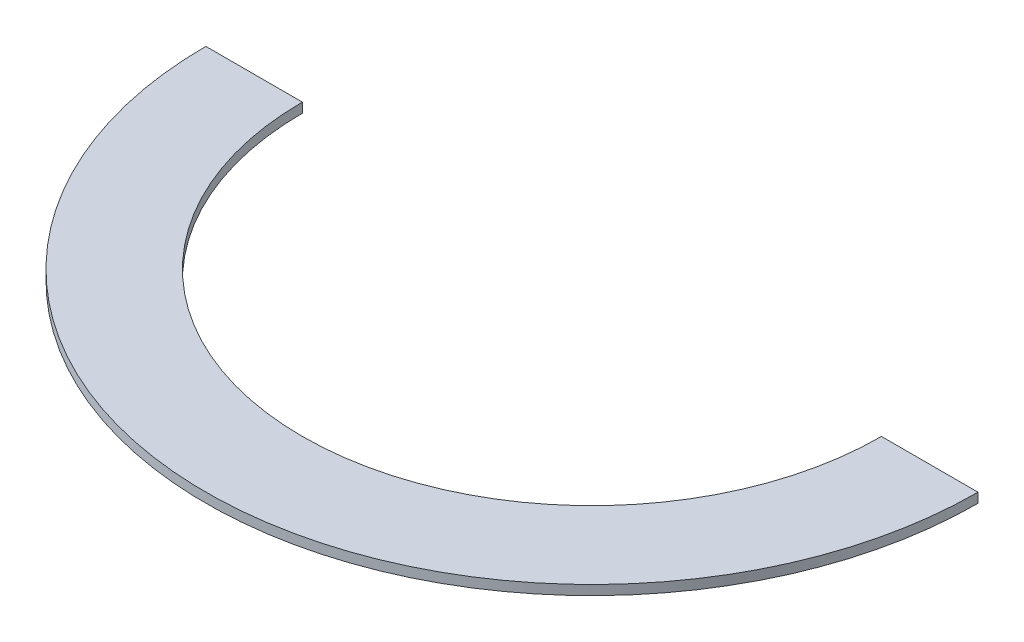
ISO-10303-21;
HEADER;
FILE_DESCRIPTION(('STEP AP214'),'2;1');
FILE_NAME('part.step','',(''),(''),'','','');
FILE_SCHEMA(('AUTOMOTIVE_DESIGN { 1 0 10303 214 1 1 1 1 }'));
ENDSEC;
DATA;
#1=APPLICATION_CONTEXT('core data for automotive mechanical design processes');
#2=APPLICATION_PROTOCOL_DEFINITION('international standard','automotive_design',2000,#1);
#3=PRODUCT_CONTEXT('',#1,'mechanical');
#4=PRODUCT('Part','Part','',(#3));
#5=PRODUCT_RELATED_PRODUCT_CATEGORY('part','',(#4));
#6=PRODUCT_DEFINITION_FORMATION('','',#4);
#7=PRODUCT_DEFINITION_CONTEXT('part definition',#1,'design');
#8=PRODUCT_DEFINITION('design','',#6,#7);
#9=PRODUCT_DEFINITION_SHAPE('','',#8);
#10=(LENGTH_UNIT() NAMED_UNIT(*) SI_UNIT(.MILLI.,.METRE.));
#11=(NAMED_UNIT(*) PLANE_ANGLE_UNIT() SI_UNIT($,.RADIAN.));
#12=(NAMED_UNIT(*) SI_UNIT($,.STERADIAN.) SOLID_ANGLE_UNIT());
#13=UNCERTAINTY_MEASURE_WITH_UNIT(LENGTH_MEASURE(1.E-05),#10,'distance_accuracy_value','');
#14=(GEOMETRIC_REPRESENTATION_CONTEXT(3) GLOBAL_UNCERTAINTY_ASSIGNED_CONTEXT((#13)) GLOBAL_UNIT_ASSIGNED_CONTEXT((#10,
#11,#12)) REPRESENTATION_CONTEXT('',''));
#15=CARTESIAN_POINT('',(0.,0.,0.));
#16=DIRECTION('',(0.,0.,1.));
#17=DIRECTION('',(1.,0.,0.));
#18=AXIS2_PLACEMENT_3D('',#15,#16,#17);
#19=CARTESIAN_POINT('',(400.,10.,0.));
#20=DIRECTION('',(0.,-1.,0.));
#21=DIRECTION('',(0.,0.,-1.));
#22=AXIS2_PLACEMENT_3D('',#19,#20,#21);
#23=CYLINDRICAL_SURFACE('',#22,400.);
#24=CARTESIAN_POINT('',(400.,0.,0.));
#25=DIRECTION('',(0.,1.,0.));
#26=DIRECTION('',(0.,0.,1.));
#27=AXIS2_PLACEMENT_3D('',#24,#25,#26);
#28=CIRCLE('',#27,400.);
#29=CARTESIAN_POINT('',(0.,0.,0.));
#30=VERTEX_POINT('',#29);
#31=CARTESIAN_POINT('',(800.,0.,0.));
#32=VERTEX_POINT('',#31);
#33=EDGE_CURVE('E94',#30,#32,#28,.T.);
#34=ORIENTED_EDGE('',*,*,#33,.T.);
#35=DIRECTION('',(0.,-1.,0.));
#36=VECTOR('',#35,1.);
#37=CARTESIAN_POINT('',(800.,10.,0.));
#38=LINE('',#37,#36);
#39=CARTESIAN_POINT('',(800.,10.,0.));
#40=VERTEX_POINT('',#39);
#41=EDGE_CURVE('E11',#40,#32,#38,.T.);
#42=ORIENTED_EDGE('',*,*,#41,.F.);
#43=CARTESIAN_POINT('',(400.,10.,0.));
#44=DIRECTION('',(0.,1.,0.));
#45=DIRECTION('',(0.,0.,1.));
#46=AXIS2_PLACEMENT_3D('',#43,#44,#45);
#47=CIRCLE('',#46,400.);
#48=CARTESIAN_POINT('',(0.,10.,0.));
#49=VERTEX_POINT('',#48);
#50=EDGE_CURVE('E82',#49,#40,#47,.T.);
#51=ORIENTED_EDGE('',*,*,#50,.F.);
#52=DIRECTION('',(0.,-1.,0.));
#53=VECTOR('',#52,1.);
#54=CARTESIAN_POINT('',(0.,10.,0.));
#55=LINE('',#54,#53);
#56=EDGE_CURVE('E90',#49,#30,#55,.T.);
#57=ORIENTED_EDGE('',*,*,#56,.T.);
#58=EDGE_LOOP('',(#34,#42,#51,#57));
#59=FACE_BOUND('',#58,.T.);
#60=ADVANCED_FACE('F31',(#59),#23,.T.);
#61=CARTESIAN_POINT('',(700.,10.,0.));
#62=DIRECTION('',(0.,0.,1.));
#63=DIRECTION('',(1.,0.,0.));
#64=AXIS2_PLACEMENT_3D('',#61,#62,#63);
#65=PLANE('',#64);
#66=DIRECTION('',(-1.,0.,0.));
#67=VECTOR('',#66,1.);
#68=CARTESIAN_POINT('',(700.,0.,0.));
#69=LINE('',#68,#67);
#70=CARTESIAN_POINT('',(700.,0.,0.));
#71=VERTEX_POINT('',#70);
#72=EDGE_CURVE('E86',#32,#71,#69,.T.);
#73=ORIENTED_EDGE('',*,*,#72,.T.);
#74=DIRECTION('',(0.,-1.,0.));
#75=VECTOR('',#74,1.);
#76=CARTESIAN_POINT('',(700.,10.,0.));
#77=LINE('',#76,#75);
#78=CARTESIAN_POINT('',(700.,10.,0.));
#79=VERTEX_POINT('',#78);
#80=EDGE_CURVE('E39',#79,#71,#77,.T.);
#81=ORIENTED_EDGE('',*,*,#80,.F.);
#82=DIRECTION('',(-1.,0.,0.));
#83=VECTOR('',#82,1.);
#84=CARTESIAN_POINT('',(700.,10.,0.));
#85=LINE('',#84,#83);
#86=EDGE_CURVE('E77',#40,#79,#85,.T.);
#87=ORIENTED_EDGE('',*,*,#86,.F.);
#88=ORIENTED_EDGE('',*,*,#41,.T.);
#89=EDGE_LOOP('',(#73,#81,#87,#88));
#90=FACE_BOUND('',#89,.T.);
#91=ADVANCED_FACE('F85',(#90),#65,.F.);
#92=CARTESIAN_POINT('',(400.,10.,0.));
#93=DIRECTION('',(0.,-1.,0.));
#94=DIRECTION('',(0.,0.,-1.));
#95=AXIS2_PLACEMENT_3D('',#92,#93,#94);
#96=CYLINDRICAL_SURFACE('',#95,300.);
#97=CARTESIAN_POINT('',(400.,0.,0.));
#98=DIRECTION('',(0.,-1.,0.));
#99=DIRECTION('',(0.,0.,1.));
#100=AXIS2_PLACEMENT_3D('',#97,#98,#99);
#101=CIRCLE('',#100,300.);
#102=CARTESIAN_POINT('',(100.,0.,0.));
#103=VERTEX_POINT('',#102);
#104=EDGE_CURVE('E64',#71,#103,#101,.T.);
#105=ORIENTED_EDGE('',*,*,#104,.T.);
#106=DIRECTION('',(0.,-1.,0.));
#107=VECTOR('',#106,1.);
#108=CARTESIAN_POINT('',(100.,10.,0.));
#109=LINE('',#108,#107);
#110=CARTESIAN_POINT('',(100.,10.,0.));
#111=VERTEX_POINT('',#110);
#112=EDGE_CURVE('E87',#111,#103,#109,.T.);
#113=ORIENTED_EDGE('',*,*,#112,.F.);
#114=CARTESIAN_POINT('',(400.,10.,0.));
#115=DIRECTION('',(0.,-1.,0.));
#116=DIRECTION('',(0.,0.,1.));
#117=AXIS2_PLACEMENT_3D('',#114,#115,#116);
#118=CIRCLE('',#117,300.);
#119=EDGE_CURVE('E80',#79,#111,#118,.T.);
#120=ORIENTED_EDGE('',*,*,#119,.F.);
#121=ORIENTED_EDGE('',*,*,#80,.T.);
#122=EDGE_LOOP('',(#105,#113,#120,#121));
#123=FACE_BOUND('',#122,.T.);
#124=ADVANCED_FACE('F88',(#123),#96,.F.);
#125=CARTESIAN_POINT('',(0.,10.,0.));
#126=DIRECTION('',(0.,0.,1.));
#127=DIRECTION('',(1.,0.,0.));
#128=AXIS2_PLACEMENT_3D('',#125,#126,#127);
#129=PLANE('',#128);
#130=DIRECTION('',(-1.,0.,0.));
#131=VECTOR('',#130,1.);
#132=CARTESIAN_POINT('',(0.,0.,0.));
#133=LINE('',#132,#131);
#134=EDGE_CURVE('E70',#103,#30,#133,.T.);
#135=ORIENTED_EDGE('',*,*,#134,.T.);
#136=ORIENTED_EDGE('',*,*,#56,.F.);
#137=DIRECTION('',(-1.,0.,0.));
#138=VECTOR('',#137,1.);
#139=CARTESIAN_POINT('',(0.,10.,0.));
#140=LINE('',#139,#138);
#141=EDGE_CURVE('E47',#111,#49,#140,.T.);
#142=ORIENTED_EDGE('',*,*,#141,.F.);
#143=ORIENTED_EDGE('',*,*,#112,.T.);
#144=EDGE_LOOP('',(#135,#136,#142,#143));
#145=FACE_BOUND('',#144,.T.);
#146=ADVANCED_FACE('F101',(#145),#129,.F.);
#147=CARTESIAN_POINT('',(400.,10.,0.));
#148=DIRECTION('',(0.,1.,0.));
#149=DIRECTION('',(0.,0.,1.));
#150=AXIS2_PLACEMENT_3D('',#147,#148,#149);
#151=PLANE('',#150);
#152=ORIENTED_EDGE('',*,*,#50,.T.);
#153=ORIENTED_EDGE('',*,*,#86,.T.);
#154=ORIENTED_EDGE('',*,*,#119,.T.);
#155=ORIENTED_EDGE('',*,*,#141,.T.);
#156=EDGE_LOOP('',(#152,#153,#154,#155));
#157=FACE_BOUND('',#156,.T.);
#158=ADVANCED_FACE('F78',(#157),#151,.T.);
#159=CARTESIAN_POINT('',(400.,0.,0.));
#160=DIRECTION('',(0.,1.,0.));
#161=DIRECTION('',(0.,0.,1.));
#162=AXIS2_PLACEMENT_3D('',#159,#160,#161);
#163=PLANE('',#162);
#164=ORIENTED_EDGE('',*,*,#33,.F.);
#165=ORIENTED_EDGE('',*,*,#134,.F.);
#166=ORIENTED_EDGE('',*,*,#104,.F.);
#167=ORIENTED_EDGE('',*,*,#72,.F.);
#168=EDGE_LOOP('',(#164,#165,#166,#167));
#169=FACE_BOUND('',#168,.T.);
#170=ADVANCED_FACE('F104',(#169),#163,.F.);
#171=CLOSED_SHELL('',(#60,#91,#124,#146,#158,#170));
#172=MANIFOLD_SOLID_BREP('B2',#171);
#173=ADVANCED_BREP_SHAPE_REPRESENTATION('',(#18,#172),#14);
#174=SHAPE_DEFINITION_REPRESENTATION(#9,#173);
ENDSEC;
END-ISO-10303-21;
